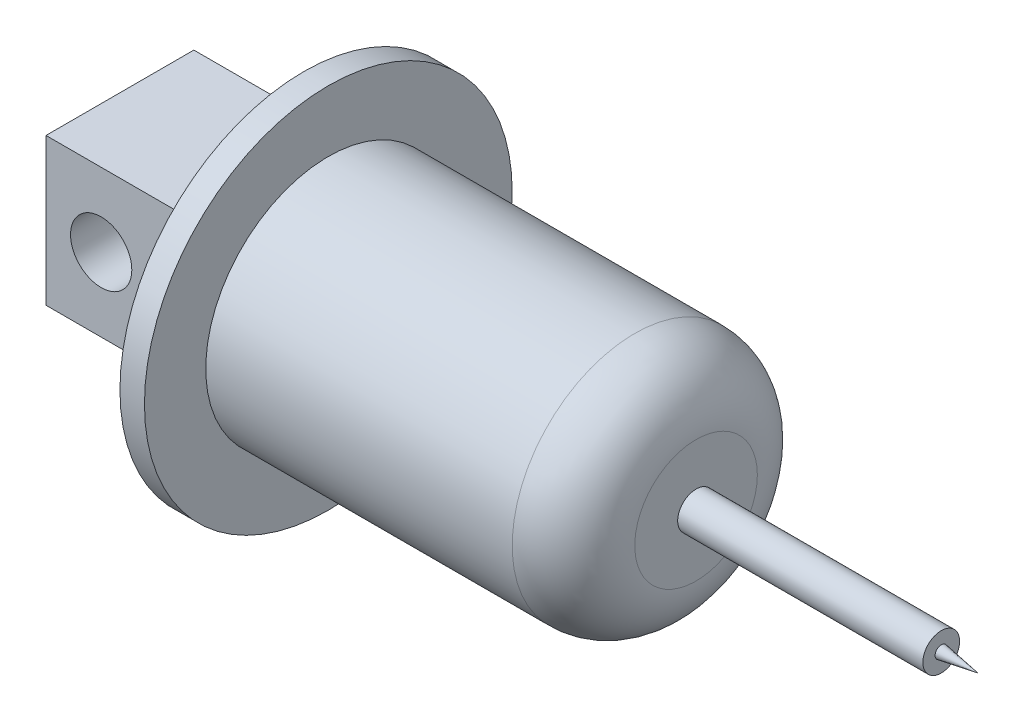
ISO-10303-21;
HEADER;
FILE_DESCRIPTION(('STEP AP214'),'2;1');
FILE_NAME('part.step','',(''),(''),'','','');
FILE_SCHEMA(('AUTOMOTIVE_DESIGN { 1 0 10303 214 1 1 1 1 }'));
ENDSEC;
DATA;
#1=APPLICATION_CONTEXT('core data for automotive mechanical design processes');
#2=APPLICATION_PROTOCOL_DEFINITION('international standard','automotive_design',2000,#1);
#3=PRODUCT_CONTEXT('',#1,'mechanical');
#4=PRODUCT('Part','Part','',(#3));
#5=PRODUCT_RELATED_PRODUCT_CATEGORY('part','',(#4));
#6=PRODUCT_DEFINITION_FORMATION('','',#4);
#7=PRODUCT_DEFINITION_CONTEXT('part definition',#1,'design');
#8=PRODUCT_DEFINITION('design','',#6,#7);
#9=PRODUCT_DEFINITION_SHAPE('','',#8);
#10=(LENGTH_UNIT() NAMED_UNIT(*) SI_UNIT(.MILLI.,.METRE.));
#11=(NAMED_UNIT(*) PLANE_ANGLE_UNIT() SI_UNIT($,.RADIAN.));
#12=(NAMED_UNIT(*) SI_UNIT($,.STERADIAN.) SOLID_ANGLE_UNIT());
#13=UNCERTAINTY_MEASURE_WITH_UNIT(LENGTH_MEASURE(1.E-05),#10,'distance_accuracy_value','');
#14=(GEOMETRIC_REPRESENTATION_CONTEXT(3) GLOBAL_UNCERTAINTY_ASSIGNED_CONTEXT((#13)) GLOBAL_UNIT_ASSIGNED_CONTEXT((#10,
#11,#12)) REPRESENTATION_CONTEXT('',''));
#15=CARTESIAN_POINT('',(0.,0.,0.));
#16=DIRECTION('',(0.,0.,1.));
#17=DIRECTION('',(1.,0.,0.));
#18=AXIS2_PLACEMENT_3D('',#15,#16,#17);
#19=CARTESIAN_POINT('',(-20.,0.,0.));
#20=DIRECTION('',(-1.,0.,0.));
#21=DIRECTION('',(0.,0.,1.));
#22=AXIS2_PLACEMENT_3D('',#19,#20,#21);
#23=CYLINDRICAL_SURFACE('',#22,10.);
#24=CARTESIAN_POINT('',(-25.,0.,0.));
#25=DIRECTION('',(1.,0.,0.));
#26=DIRECTION('',(0.,0.,-1.));
#27=AXIS2_PLACEMENT_3D('',#24,#25,#26);
#28=CIRCLE('',#27,10.);
#29=CARTESIAN_POINT('',(-25.,0.,-9.99999999999991));
#30=VERTEX_POINT('',#29);
#31=EDGE_CURVE('E11',#30,#30,#28,.F.);
#32=ORIENTED_EDGE('',*,*,#31,.T.);
#33=EDGE_LOOP('',(#32));
#34=FACE_BOUND('',#33,.T.);
#35=CARTESIAN_POINT('',(-50.,0.,1.74894432217042E-13));
#36=DIRECTION('',(1.,0.,0.));
#37=DIRECTION('',(0.,0.,-1.));
#38=AXIS2_PLACEMENT_3D('',#35,#36,#37);
#39=CIRCLE('',#38,10.);
#40=CARTESIAN_POINT('',(-50.,0.,-9.99999999999982));
#41=VERTEX_POINT('',#40);
#42=EDGE_CURVE('E165',#41,#41,#39,.T.);
#43=ORIENTED_EDGE('',*,*,#42,.T.);
#44=EDGE_LOOP('',(#43));
#45=FACE_BOUND('',#44,.T.);
#46=ADVANCED_FACE('F32',(#34,#45),#23,.T.);
#47=CARTESIAN_POINT('',(-20.,0.,0.));
#48=DIRECTION('',(1.,0.,0.));
#49=DIRECTION('',(0.,0.,-1.));
#50=AXIS2_PLACEMENT_3D('',#47,#48,#49);
#51=PLANE('',#50);
#52=CARTESIAN_POINT('',(-20.,0.,0.));
#53=DIRECTION('',(1.,0.,0.));
#54=DIRECTION('',(0.,0.,-1.));
#55=AXIS2_PLACEMENT_3D('',#52,#53,#54);
#56=CIRCLE('',#55,1.5);
#57=CARTESIAN_POINT('',(-20.,0.,-1.49999999999993));
#58=VERTEX_POINT('',#57);
#59=EDGE_CURVE('E148',#58,#58,#56,.T.);
#60=ORIENTED_EDGE('',*,*,#59,.F.);
#61=EDGE_LOOP('',(#60));
#62=FACE_BOUND('',#61,.T.);
#63=CARTESIAN_POINT('',(-20.,0.,0.));
#64=DIRECTION('',(1.,0.,0.));
#65=DIRECTION('',(0.,0.,-1.));
#66=AXIS2_PLACEMENT_3D('',#63,#64,#65);
#67=CIRCLE('',#66,5.);
#68=CARTESIAN_POINT('',(-20.,0.,-4.99999999999993));
#69=VERTEX_POINT('',#68);
#70=EDGE_CURVE('E40',#69,#69,#67,.T.);
#71=ORIENTED_EDGE('',*,*,#70,.T.);
#72=EDGE_LOOP('',(#71));
#73=FACE_BOUND('',#72,.T.);
#74=ADVANCED_FACE('F85',(#62,#73),#51,.T.);
#75=CARTESIAN_POINT('',(-52.,0.,1.81877394894729E-13));
#76=DIRECTION('',(1.,0.,0.));
#77=DIRECTION('',(0.,0.,-1.));
#78=AXIS2_PLACEMENT_3D('',#75,#76,#77);
#79=CYLINDRICAL_SURFACE('',#78,15.);
#80=CARTESIAN_POINT('',(-52.,0.,1.81877394894729E-13));
#81=DIRECTION('',(-1.,0.,0.));
#82=DIRECTION('',(0.,0.,1.));
#83=AXIS2_PLACEMENT_3D('',#80,#81,#82);
#84=CIRCLE('',#83,15.);
#85=CARTESIAN_POINT('',(-52.,0.,15.0000000000002));
#86=VERTEX_POINT('',#85);
#87=EDGE_CURVE('E162',#86,#86,#84,.T.);
#88=ORIENTED_EDGE('',*,*,#87,.F.);
#89=EDGE_LOOP('',(#88));
#90=FACE_BOUND('',#89,.T.);
#91=CARTESIAN_POINT('',(-50.,0.,1.74894432217042E-13));
#92=DIRECTION('',(-1.,0.,0.));
#93=DIRECTION('',(0.,0.,1.));
#94=AXIS2_PLACEMENT_3D('',#91,#92,#93);
#95=CIRCLE('',#94,15.);
#96=CARTESIAN_POINT('',(-50.,0.,15.0000000000002));
#97=VERTEX_POINT('',#96);
#98=EDGE_CURVE('E160',#97,#97,#95,.T.);
#99=ORIENTED_EDGE('',*,*,#98,.T.);
#100=EDGE_LOOP('',(#99));
#101=FACE_BOUND('',#100,.T.);
#102=ADVANCED_FACE('F90',(#90,#101),#79,.T.);
#103=CARTESIAN_POINT('',(-52.,0.,1.81877394894729E-13));
#104=DIRECTION('',(-1.,0.,0.));
#105=DIRECTION('',(0.,0.,1.));
#106=AXIS2_PLACEMENT_3D('',#103,#104,#105);
#107=PLANE('',#106);
#108=DIRECTION('',(0.,-1.,0.));
#109=VECTOR('',#108,1.);
#110=CARTESIAN_POINT('',(-52.,-6.,-6.03128939533191));
#111=LINE('',#110,#109);
#112=CARTESIAN_POINT('',(-52.,6.,-6.03128939533191));
#113=VERTEX_POINT('',#112);
#114=CARTESIAN_POINT('',(-52.,-6.,-6.03128939533191));
#115=VERTEX_POINT('',#114);
#116=EDGE_CURVE('E47',#113,#115,#111,.T.);
#117=ORIENTED_EDGE('',*,*,#116,.F.);
#118=DIRECTION('',(0.,0.,-1.));
#119=VECTOR('',#118,1.);
#120=CARTESIAN_POINT('',(-52.,6.,6.03128939533228));
#121=LINE('',#120,#119);
#122=CARTESIAN_POINT('',(-52.,6.,6.03128939533228));
#123=VERTEX_POINT('',#122);
#124=EDGE_CURVE('E51',#123,#113,#121,.T.);
#125=ORIENTED_EDGE('',*,*,#124,.F.);
#126=DIRECTION('',(0.,1.,0.));
#127=VECTOR('',#126,1.);
#128=CARTESIAN_POINT('',(-52.,-6.,6.03128939533228));
#129=LINE('',#128,#127);
#130=CARTESIAN_POINT('',(-52.,-6.,6.03128939533228));
#131=VERTEX_POINT('',#130);
#132=EDGE_CURVE('E275',#131,#123,#129,.T.);
#133=ORIENTED_EDGE('',*,*,#132,.F.);
#134=DIRECTION('',(0.,0.,1.));
#135=VECTOR('',#134,1.);
#136=CARTESIAN_POINT('',(-52.,-6.,6.03128939533228));
#137=LINE('',#136,#135);
#138=EDGE_CURVE('E277',#115,#131,#137,.T.);
#139=ORIENTED_EDGE('',*,*,#138,.F.);
#140=EDGE_LOOP('',(#117,#125,#133,#139));
#141=FACE_BOUND('',#140,.T.);
#142=ORIENTED_EDGE('',*,*,#87,.T.);
#143=EDGE_LOOP('',(#142));
#144=FACE_BOUND('',#143,.T.);
#145=ADVANCED_FACE('F97',(#141,#144),#107,.T.);
#146=CARTESIAN_POINT('',(-50.,0.,1.74894432217042E-13));
#147=DIRECTION('',(-1.,0.,0.));
#148=DIRECTION('',(0.,0.,1.));
#149=AXIS2_PLACEMENT_3D('',#146,#147,#148);
#150=PLANE('',#149);
#151=ORIENTED_EDGE('',*,*,#42,.F.);
#152=EDGE_LOOP('',(#151));
#153=FACE_BOUND('',#152,.T.);
#154=ORIENTED_EDGE('',*,*,#98,.F.);
#155=EDGE_LOOP('',(#154));
#156=FACE_BOUND('',#155,.T.);
#157=ADVANCED_FACE('F99',(#153,#156),#150,.F.);
#158=CARTESIAN_POINT('',(-25.,0.,0.));
#159=DIRECTION('',(1.,0.,0.));
#160=DIRECTION('',(0.,0.,-1.));
#161=AXIS2_PLACEMENT_3D('',#158,#159,#160);
#162=DEGENERATE_TOROIDAL_SURFACE('',#161,5.,5.,.T.);
#163=ORIENTED_EDGE('',*,*,#31,.F.);
#164=EDGE_LOOP('',(#163));
#165=FACE_BOUND('',#164,.T.);
#166=ORIENTED_EDGE('',*,*,#70,.F.);
#167=EDGE_LOOP('',(#166));
#168=FACE_BOUND('',#167,.T.);
#169=ADVANCED_FACE('F34',(#165,#168),#162,.T.);
#170=CARTESIAN_POINT('',(0.,0.,0.));
#171=DIRECTION('',(-1.,0.,0.));
#172=DIRECTION('',(0.,0.,1.));
#173=AXIS2_PLACEMENT_3D('',#170,#171,#172);
#174=CYLINDRICAL_SURFACE('',#173,1.5);
#175=CARTESIAN_POINT('',(0.,0.,0.));
#176=DIRECTION('',(1.,0.,0.));
#177=DIRECTION('',(0.,0.,-1.));
#178=AXIS2_PLACEMENT_3D('',#175,#176,#177);
#179=CIRCLE('',#178,1.5);
#180=CARTESIAN_POINT('',(0.,0.,-1.5));
#181=VERTEX_POINT('',#180);
#182=EDGE_CURVE('E152',#181,#181,#179,.T.);
#183=ORIENTED_EDGE('',*,*,#182,.F.);
#184=EDGE_LOOP('',(#183));
#185=FACE_BOUND('',#184,.T.);
#186=ORIENTED_EDGE('',*,*,#59,.T.);
#187=EDGE_LOOP('',(#186));
#188=FACE_BOUND('',#187,.T.);
#189=ADVANCED_FACE('F105',(#185,#188),#174,.T.);
#190=CARTESIAN_POINT('',(0.,0.,0.));
#191=DIRECTION('',(1.,0.,0.));
#192=DIRECTION('',(0.,0.,-1.));
#193=AXIS2_PLACEMENT_3D('',#190,#191,#192);
#194=PLANE('',#193);
#195=CARTESIAN_POINT('',(0.,0.,0.));
#196=DIRECTION('',(-1.,0.,0.));
#197=DIRECTION('',(0.,0.,1.));
#198=AXIS2_PLACEMENT_3D('',#195,#196,#197);
#199=CIRCLE('',#198,0.5);
#200=CARTESIAN_POINT('',(0.,0.,0.5));
#201=VERTEX_POINT('',#200);
#202=EDGE_CURVE('E290',#201,#201,#199,.T.);
#203=ORIENTED_EDGE('',*,*,#202,.T.);
#204=EDGE_LOOP('',(#203));
#205=FACE_BOUND('',#204,.T.);
#206=ORIENTED_EDGE('',*,*,#182,.T.);
#207=EDGE_LOOP('',(#206));
#208=FACE_BOUND('',#207,.T.);
#209=ADVANCED_FACE('F108',(#205,#208),#194,.T.);
#210=CARTESIAN_POINT('',(-67.,-6.,-6.03128939533186));
#211=DIRECTION('',(0.,0.,1.));
#212=DIRECTION('',(1.,0.,0.));
#213=AXIS2_PLACEMENT_3D('',#210,#211,#212);
#214=PLANE('',#213);
#215=CARTESIAN_POINT('',(-62.5,0.,-6.03128939533188));
#216=DIRECTION('',(0.,0.,1.));
#217=DIRECTION('',(1.,0.,0.));
#218=AXIS2_PLACEMENT_3D('',#215,#216,#217);
#219=CIRCLE('',#218,2.5);
#220=CARTESIAN_POINT('',(-60.,0.,-6.03128939533189));
#221=VERTEX_POINT('',#220);
#222=EDGE_CURVE('E280',#221,#221,#219,.T.);
#223=ORIENTED_EDGE('',*,*,#222,.T.);
#224=EDGE_LOOP('',(#223));
#225=FACE_BOUND('',#224,.T.);
#226=ORIENTED_EDGE('',*,*,#116,.T.);
#227=DIRECTION('',(1.,0.,0.));
#228=VECTOR('',#227,1.);
#229=CARTESIAN_POINT('',(-67.,-6.,-6.03128939533186));
#230=LINE('',#229,#228);
#231=CARTESIAN_POINT('',(-67.,-6.,-6.03128939533186));
#232=VERTEX_POINT('',#231);
#233=EDGE_CURVE('E146',#232,#115,#230,.T.);
#234=ORIENTED_EDGE('',*,*,#233,.F.);
#235=DIRECTION('',(0.,-1.,0.));
#236=VECTOR('',#235,1.);
#237=CARTESIAN_POINT('',(-67.,-6.,-6.03128939533186));
#238=LINE('',#237,#236);
#239=CARTESIAN_POINT('',(-67.,6.,-6.03128939533186));
#240=VERTEX_POINT('',#239);
#241=EDGE_CURVE('E135',#240,#232,#238,.T.);
#242=ORIENTED_EDGE('',*,*,#241,.F.);
#243=DIRECTION('',(1.,0.,0.));
#244=VECTOR('',#243,1.);
#245=CARTESIAN_POINT('',(-67.,6.,-6.03128939533186));
#246=LINE('',#245,#244);
#247=EDGE_CURVE('E272',#240,#113,#246,.T.);
#248=ORIENTED_EDGE('',*,*,#247,.T.);
#249=EDGE_LOOP('',(#226,#234,#242,#248));
#250=FACE_BOUND('',#249,.T.);
#251=ADVANCED_FACE('F112',(#225,#250),#214,.F.);
#252=CARTESIAN_POINT('',(-67.,-6.,6.03128939533233));
#253=DIRECTION('',(0.,1.,0.));
#254=DIRECTION('',(0.,0.,1.));
#255=AXIS2_PLACEMENT_3D('',#252,#253,#254);
#256=PLANE('',#255);
#257=ORIENTED_EDGE('',*,*,#138,.T.);
#258=DIRECTION('',(1.,0.,0.));
#259=VECTOR('',#258,1.);
#260=CARTESIAN_POINT('',(-67.,-6.,6.03128939533233));
#261=LINE('',#260,#259);
#262=CARTESIAN_POINT('',(-67.,-6.,6.03128939533233));
#263=VERTEX_POINT('',#262);
#264=EDGE_CURVE('E149',#263,#131,#261,.T.);
#265=ORIENTED_EDGE('',*,*,#264,.F.);
#266=DIRECTION('',(0.,0.,1.));
#267=VECTOR('',#266,1.);
#268=CARTESIAN_POINT('',(-67.,-6.,6.03128939533233));
#269=LINE('',#268,#267);
#270=EDGE_CURVE('E137',#232,#263,#269,.T.);
#271=ORIENTED_EDGE('',*,*,#270,.F.);
#272=ORIENTED_EDGE('',*,*,#233,.T.);
#273=EDGE_LOOP('',(#257,#265,#271,#272));
#274=FACE_BOUND('',#273,.T.);
#275=ADVANCED_FACE('F116',(#274),#256,.F.);
#276=CARTESIAN_POINT('',(-67.,-6.,6.03128939533233));
#277=DIRECTION('',(0.,0.,-1.));
#278=DIRECTION('',(-1.,0.,0.));
#279=AXIS2_PLACEMENT_3D('',#276,#277,#278);
#280=PLANE('',#279);
#281=CARTESIAN_POINT('',(-62.5,0.,6.03128939533231));
#282=DIRECTION('',(0.,0.,1.));
#283=DIRECTION('',(1.,0.,0.));
#284=AXIS2_PLACEMENT_3D('',#281,#282,#283);
#285=CIRCLE('',#284,2.5);
#286=CARTESIAN_POINT('',(-60.,0.,6.0312893953323));
#287=VERTEX_POINT('',#286);
#288=EDGE_CURVE('E287',#287,#287,#285,.T.);
#289=ORIENTED_EDGE('',*,*,#288,.F.);
#290=EDGE_LOOP('',(#289));
#291=FACE_BOUND('',#290,.T.);
#292=ORIENTED_EDGE('',*,*,#132,.T.);
#293=DIRECTION('',(1.,0.,0.));
#294=VECTOR('',#293,1.);
#295=CARTESIAN_POINT('',(-67.,6.,6.03128939533233));
#296=LINE('',#295,#294);
#297=CARTESIAN_POINT('',(-67.,6.,6.03128939533233));
#298=VERTEX_POINT('',#297);
#299=EDGE_CURVE('E155',#298,#123,#296,.T.);
#300=ORIENTED_EDGE('',*,*,#299,.F.);
#301=DIRECTION('',(0.,1.,0.));
#302=VECTOR('',#301,1.);
#303=CARTESIAN_POINT('',(-67.,-6.,6.03128939533233));
#304=LINE('',#303,#302);
#305=EDGE_CURVE('E282',#263,#298,#304,.T.);
#306=ORIENTED_EDGE('',*,*,#305,.F.);
#307=ORIENTED_EDGE('',*,*,#264,.T.);
#308=EDGE_LOOP('',(#292,#300,#306,#307));
#309=FACE_BOUND('',#308,.T.);
#310=ADVANCED_FACE('F120',(#291,#309),#280,.F.);
#311=CARTESIAN_POINT('',(-67.,6.,6.03128939533233));
#312=DIRECTION('',(0.,-1.,0.));
#313=DIRECTION('',(0.,0.,-1.));
#314=AXIS2_PLACEMENT_3D('',#311,#312,#313);
#315=PLANE('',#314);
#316=ORIENTED_EDGE('',*,*,#124,.T.);
#317=ORIENTED_EDGE('',*,*,#247,.F.);
#318=DIRECTION('',(0.,0.,-1.));
#319=VECTOR('',#318,1.);
#320=CARTESIAN_POINT('',(-67.,6.,6.03128939533233));
#321=LINE('',#320,#319);
#322=EDGE_CURVE('E140',#298,#240,#321,.T.);
#323=ORIENTED_EDGE('',*,*,#322,.F.);
#324=ORIENTED_EDGE('',*,*,#299,.T.);
#325=EDGE_LOOP('',(#316,#317,#323,#324));
#326=FACE_BOUND('',#325,.T.);
#327=ADVANCED_FACE('F124',(#326),#315,.F.);
#328=CARTESIAN_POINT('',(-67.,0.,2.34249614977376E-13));
#329=DIRECTION('',(-1.,0.,0.));
#330=DIRECTION('',(0.,0.,1.));
#331=AXIS2_PLACEMENT_3D('',#328,#329,#330);
#332=PLANE('',#331);
#333=ORIENTED_EDGE('',*,*,#241,.T.);
#334=ORIENTED_EDGE('',*,*,#270,.T.);
#335=ORIENTED_EDGE('',*,*,#305,.T.);
#336=ORIENTED_EDGE('',*,*,#322,.T.);
#337=EDGE_LOOP('',(#333,#334,#335,#336));
#338=FACE_BOUND('',#337,.T.);
#339=ADVANCED_FACE('F80',(#338),#332,.T.);
#340=CARTESIAN_POINT('',(-62.5000000000001,0.,-14.9999999999998));
#341=DIRECTION('',(0.,0.,1.));
#342=DIRECTION('',(1.,0.,0.));
#343=AXIS2_PLACEMENT_3D('',#340,#341,#342);
#344=CYLINDRICAL_SURFACE('',#343,2.5);
#345=ORIENTED_EDGE('',*,*,#288,.T.);
#346=EDGE_LOOP('',(#345));
#347=FACE_BOUND('',#346,.T.);
#348=ORIENTED_EDGE('',*,*,#222,.F.);
#349=EDGE_LOOP('',(#348));
#350=FACE_BOUND('',#349,.T.);
#351=ADVANCED_FACE('F74',(#347,#350),#344,.F.);
#352=CARTESIAN_POINT('',(3.,0.,0.));
#353=DIRECTION('',(-1.,0.,0.));
#354=DIRECTION('',(0.,0.,1.));
#355=AXIS2_PLACEMENT_3D('',#352,#353,#354);
#356=CONICAL_SURFACE('',#355,0.,0.165148677414627);
#357=ORIENTED_EDGE('',*,*,#202,.F.);
#358=EDGE_LOOP('',(#357));
#359=FACE_BOUND('',#358,.T.);
#360=CARTESIAN_POINT('',(3.,0.,0.));
#361=VERTEX_POINT('',#360);
#362=VERTEX_LOOP('',#361);
#363=FACE_BOUND('',#362,.T.);
#364=ADVANCED_FACE('F72',(#359,#363),#356,.T.);
#365=CLOSED_SHELL('',(#46,#74,#102,#145,#157,#169,#189,#209,#251,#275,#310,#327,#339,#351,#364));
#366=MANIFOLD_SOLID_BREP('B2',#365);
#367=ADVANCED_BREP_SHAPE_REPRESENTATION('',(#18,#366),#14);
#368=SHAPE_DEFINITION_REPRESENTATION(#9,#367);
ENDSEC;
END-ISO-10303-21;
